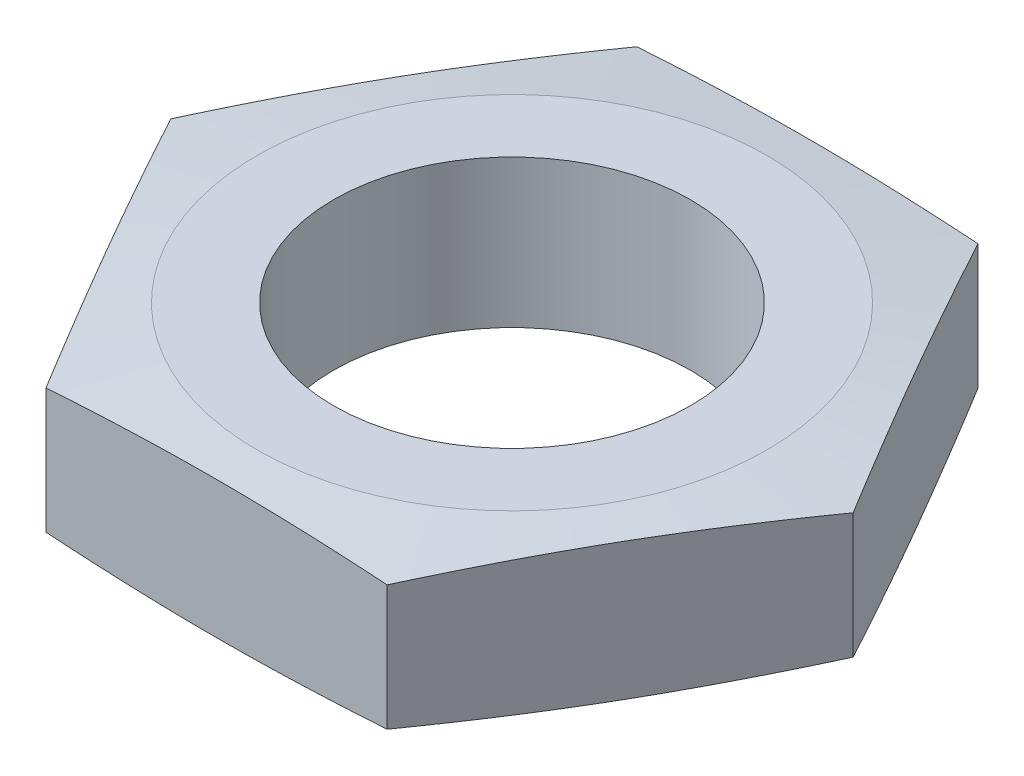
ISO-10303-21;
HEADER;
FILE_DESCRIPTION(('STEP AP214'),'2;1');
FILE_NAME('part.step','',(''),(''),'','','');
FILE_SCHEMA(('AUTOMOTIVE_DESIGN { 1 0 10303 214 1 1 1 1 }'));
ENDSEC;
DATA;
#1=APPLICATION_CONTEXT('core data for automotive mechanical design processes');
#2=APPLICATION_PROTOCOL_DEFINITION('international standard','automotive_design',2000,#1);
#3=PRODUCT_CONTEXT('',#1,'mechanical');
#4=PRODUCT('Part','Part','',(#3));
#5=PRODUCT_RELATED_PRODUCT_CATEGORY('part','',(#4));
#6=PRODUCT_DEFINITION_FORMATION('','',#4);
#7=PRODUCT_DEFINITION_CONTEXT('part definition',#1,'design');
#8=PRODUCT_DEFINITION('design','',#6,#7);
#9=PRODUCT_DEFINITION_SHAPE('','',#8);
#10=(LENGTH_UNIT() NAMED_UNIT(*) SI_UNIT(.MILLI.,.METRE.));
#11=(NAMED_UNIT(*) PLANE_ANGLE_UNIT() SI_UNIT($,.RADIAN.));
#12=(NAMED_UNIT(*) SI_UNIT($,.STERADIAN.) SOLID_ANGLE_UNIT());
#13=UNCERTAINTY_MEASURE_WITH_UNIT(LENGTH_MEASURE(1.E-05),#10,'distance_accuracy_value','');
#14=(GEOMETRIC_REPRESENTATION_CONTEXT(3) GLOBAL_UNCERTAINTY_ASSIGNED_CONTEXT((#13)) GLOBAL_UNIT_ASSIGNED_CONTEXT((#10,
#11,#12)) REPRESENTATION_CONTEXT('',''));
#15=CARTESIAN_POINT('',(0.,0.,0.));
#16=DIRECTION('',(0.,0.,1.));
#17=DIRECTION('',(1.,0.,0.));
#18=AXIS2_PLACEMENT_3D('',#15,#16,#17);
#19=CARTESIAN_POINT('',(13.856406460551,6.,0.));
#20=DIRECTION('',(-0.866025403784439,0.,0.5));
#21=DIRECTION('',(0.5,0.,0.866025403784439));
#22=AXIS2_PLACEMENT_3D('',#19,#20,#21);
#23=PLANE('',#22);
#24=CARTESIAN_POINT('',(13.8565219306049,5.53920105633311,0.000199999999998318));
#25=CARTESIAN_POINT('',(13.568071895555,5.5771929441104,-0.499410116151427));
#26=CARTESIAN_POINT('',(13.2794939637158,5.61161953747138,-0.999241756040067));
#27=CARTESIAN_POINT('',(12.7020915962059,5.67202825893365,-1.99933199297773));
#28=CARTESIAN_POINT('',(12.4132671398972,5.69800959222564,-2.49959062577279));
#29=CARTESIAN_POINT('',(11.8357975323813,5.74017982050631,-3.49979732581717));
#30=CARTESIAN_POINT('',(11.5471526103685,5.75638095189157,-3.99974499609018));
#31=CARTESIAN_POINT('',(10.9697734043392,5.77809920644825,-4.99979511616666));
#32=CARTESIAN_POINT('',(10.6810391248762,5.78361680551303,-5.49989755808333));
#33=CARTESIAN_POINT('',(10.1035705659503,5.78361680551303,-6.50010244191667));
#34=CARTESIAN_POINT('',(9.81483628648731,5.77809920644825,-7.00020488383334));
#35=CARTESIAN_POINT('',(9.23745708045804,5.75638095189157,-8.00025500390982));
#36=CARTESIAN_POINT('',(8.94881215844519,5.74017982050631,-8.50020267418283));
#37=CARTESIAN_POINT('',(8.3713425509293,5.69800959222564,-9.50040937422721));
#38=CARTESIAN_POINT('',(8.08251809462064,5.67202825893365,-10.0006680070223));
#39=CARTESIAN_POINT('',(7.50511572711076,5.61161953747139,-11.0007582439599));
#40=CARTESIAN_POINT('',(7.21653779527156,5.5771929441104,-11.5005898838486));
#41=CARTESIAN_POINT('',(6.92808776022167,5.53920105633312,-12.0002));
#42=B_SPLINE_CURVE_WITH_KNOTS('',3,(#24,#25,#26,#27,#28,#29,#30,#31,#32,#33,#34,#35,#36,#37,#38,
#39,#40,#41),.UNSPECIFIED.,.F.,.F.,(4,2,2,2,2,2,2,2,4),(0.,1.73446964464179,3.46910247830202,
5.20156052196439,6.93394139225431,8.66632226254422,10.3987803062066,12.1334131398668,
13.8678827845086),.UNSPECIFIED.);
#43=CARTESIAN_POINT('',(13.856406460551,5.53921625844412,0.));
#44=VERTEX_POINT('',#43);
#45=CARTESIAN_POINT('',(6.92820323027551,5.53921625844412,-12.));
#46=VERTEX_POINT('',#45);
#47=EDGE_CURVE('E89',#44,#46,#42,.T.);
#48=ORIENTED_EDGE('',*,*,#47,.F.);
#49=DIRECTION('',(0.,-1.,0.));
#50=VECTOR('',#49,1.);
#51=CARTESIAN_POINT('',(13.856406460551,6.,0.));
#52=LINE('',#51,#50);
#53=CARTESIAN_POINT('',(13.856406460551,0.460783741555837,0.));
#54=VERTEX_POINT('',#53);
#55=EDGE_CURVE('E59',#44,#54,#52,.T.);
#56=ORIENTED_EDGE('',*,*,#55,.T.);
#57=CARTESIAN_POINT('',(6.92808776022167,0.46079894366685,-12.0002));
#58=CARTESIAN_POINT('',(7.21653779527156,0.422807055889563,-11.5005898838486));
#59=CARTESIAN_POINT('',(7.50511572711076,0.388380462528575,-11.0007582439599));
#60=CARTESIAN_POINT('',(8.08251809462064,0.327971741066314,-10.0006680070223));
#61=CARTESIAN_POINT('',(8.3713425509293,0.301990407774326,-9.50040937422721));
#62=CARTESIAN_POINT('',(8.94881215844519,0.25982017949365,-8.50020267418283));
#63=CARTESIAN_POINT('',(9.23745708045804,0.243619048108396,-8.00025500390982));
#64=CARTESIAN_POINT('',(9.81483628648731,0.22190079355171,-7.00020488383334));
#65=CARTESIAN_POINT('',(10.1035705659503,0.216383194486936,-6.50010244191667));
#66=CARTESIAN_POINT('',(10.6810391248762,0.216383194486935,-5.49989755808333));
#67=CARTESIAN_POINT('',(10.9697734043392,0.221900793551709,-4.99979511616667));
#68=CARTESIAN_POINT('',(11.5471526103685,0.243619048108394,-3.99974499609018));
#69=CARTESIAN_POINT('',(11.8357975323813,0.259820179493647,-3.49979732581717));
#70=CARTESIAN_POINT('',(12.4132671398972,0.301990407774322,-2.49959062577279));
#71=CARTESIAN_POINT('',(12.7020915962059,0.32797174106631,-1.99933199297773));
#72=CARTESIAN_POINT('',(13.2794939637158,0.38838046252857,-0.999241756040064));
#73=CARTESIAN_POINT('',(13.568071895555,0.422807055889557,-0.499410116151426));
#74=CARTESIAN_POINT('',(13.8565219306049,0.460798943666844,0.000200000000000654));
#75=B_SPLINE_CURVE_WITH_KNOTS('',3,(#57,#58,#59,#60,#61,#62,#63,#64,#65,#66,#67,#68,#69,#70,#71,
#72,#73,#74),.UNSPECIFIED.,.F.,.F.,(4,2,2,2,2,2,2,2,4),(0.,1.73446964464178,3.46910247830202,
5.2015605219644,6.93394139225431,8.66632226254423,10.3987803062066,12.1334131398668,
13.8678827845086),.UNSPECIFIED.);
#76=CARTESIAN_POINT('',(6.9282032302755,0.460783741555843,-12.));
#77=VERTEX_POINT('',#76);
#78=EDGE_CURVE('E104',#77,#54,#75,.T.);
#79=ORIENTED_EDGE('',*,*,#78,.F.);
#80=DIRECTION('',(0.,-1.,0.));
#81=VECTOR('',#80,1.);
#82=CARTESIAN_POINT('',(6.92820323027551,6.,-12.));
#83=LINE('',#82,#81);
#84=EDGE_CURVE('E11',#46,#77,#83,.T.);
#85=ORIENTED_EDGE('',*,*,#84,.F.);
#86=EDGE_LOOP('',(#48,#56,#79,#85));
#87=FACE_BOUND('',#86,.T.);
#88=ADVANCED_FACE('F36',(#87),#23,.F.);
#89=CARTESIAN_POINT('',(6.92820323027551,6.,-12.));
#90=DIRECTION('',(0.,0.,1.));
#91=DIRECTION('',(1.,0.,0.));
#92=AXIS2_PLACEMENT_3D('',#89,#90,#91);
#93=PLANE('',#92);
#94=CARTESIAN_POINT('',(-18.2771435435556,4.48493792086526,-12.));
#95=CARTESIAN_POINT('',(-17.7325022290371,4.54486147563487,-12.));
#96=CARTESIAN_POINT('',(-17.1877749278224,4.60401723246416,-12.));
#97=CARTESIAN_POINT('',(-16.0981074868908,4.7203897679879,-12.));
#98=CARTESIAN_POINT('',(-15.5531673449194,4.77760652554683,-12.));
#99=CARTESIAN_POINT('',(-14.4629154682547,4.88970969877349,-12.));
#100=CARTESIAN_POINT('',(-13.9176036759832,4.94459555643758,-12.));
#101=CARTESIAN_POINT('',(-12.8266980870495,5.05148740141514,-12.));
#102=CARTESIAN_POINT('',(-12.2811042909962,5.10349339492182,-12.));
#103=CARTESIAN_POINT('',(-11.1905992029574,5.20387294502393,-12.));
#104=CARTESIAN_POINT('',(-10.6456885162395,5.25225304519558,-12.));
#105=CARTESIAN_POINT('',(-9.55550024084136,5.34467830956093,-12.));
#106=CARTESIAN_POINT('',(-9.01022265415777,5.38872349715577,-12.));
#107=CARTESIAN_POINT('',(-7.91927972672171,5.47151120988976,-12.));
#108=CARTESIAN_POINT('',(-7.37361439930037,5.51025390923629,-12.));
#109=CARTESIAN_POINT('',(-6.28186232976823,5.58133287411642,-12.));
#110=CARTESIAN_POINT('',(-5.73577558780116,5.61366914183417,-12.));
#111=CARTESIAN_POINT('',(-4.6417904877832,5.67083539164291,-12.));
#112=CARTESIAN_POINT('',(-4.09389109194578,5.69564578304351,-12.));
#113=CARTESIAN_POINT('',(-2.99776378518072,5.73653632009702,-12.));
#114=CARTESIAN_POINT('',(-2.44953587577036,5.75261650576497,-12.));
#115=CARTESIAN_POINT('',(-1.35293331086945,5.77520595095389,-12.));
#116=CARTESIAN_POINT('',(-0.804558675176236,5.78171615394902,-12.));
#117=CARTESIAN_POINT('',(0.292218868370737,5.78479758621478,-12.));
#118=CARTESIAN_POINT('',(0.840621776214361,5.78136881902403,-12.));
#119=CARTESIAN_POINT('',(1.93775589306152,5.76476284221265,-12.));
#120=CARTESIAN_POINT('',(2.48648697089035,5.75157712748093,-12.));
#121=CARTESIAN_POINT('',(3.58365446599168,5.71616154703021,-12.));
#122=CARTESIAN_POINT('',(4.13209088201244,5.6939316431903,-12.));
#123=CARTESIAN_POINT('',(5.22865127633366,5.64147629892808,-12.));
#124=CARTESIAN_POINT('',(5.77677520123959,5.611249758411,-12.));
#125=CARTESIAN_POINT('',(6.87260061439445,5.54398479030612,-12.));
#126=CARTESIAN_POINT('',(7.42030210222779,5.50694635602535,-12.));
#127=CARTESIAN_POINT('',(8.48783189709877,5.42920514261799,-12.));
#128=CARTESIAN_POINT('',(9.00768056776549,5.38877928146919,-12.));
#129=CARTESIAN_POINT('',(10.0470332733152,5.30369631349215,-12.));
#130=CARTESIAN_POINT('',(10.5665373056549,5.25903917578146,-12.));
#131=CARTESIAN_POINT('',(11.6052458893714,5.16624531684368,-12.));
#132=CARTESIAN_POINT('',(12.1244504330513,5.11810850988297,-12.));
#133=CARTESIAN_POINT('',(13.162586978277,5.01897365011092,-12.));
#134=CARTESIAN_POINT('',(13.6815189788542,4.96797558720039,-12.));
#135=CARTESIAN_POINT('',(15.23805447269,4.81146821006901,-12.));
#136=CARTESIAN_POINT('',(16.2753052031246,4.70245414511181,-12.));
#137=CARTESIAN_POINT('',(18.3490936670876,4.47805703077449,-12.));
#138=CARTESIAN_POINT('',(19.3856314114897,4.36267408081,-12.));
#139=CARTESIAN_POINT('',(21.4557376658167,4.12770097118489,-12.));
#140=CARTESIAN_POINT('',(22.4893073858952,4.00812144243749,-12.));
#141=CARTESIAN_POINT('',(24.5560728834144,3.76574040860357,-12.));
#142=CARTESIAN_POINT('',(25.5892686589956,3.64293888771143,-12.));
#143=CARTESIAN_POINT('',(27.654995141797,3.39500739063223,-12.));
#144=CARTESIAN_POINT('',(28.6875259538995,3.26987828650609,-12.));
#145=CARTESIAN_POINT('',(30.7523551718,3.01779291280188,-12.));
#146=CARTESIAN_POINT('',(31.7846535796201,2.89083665979841,-12.));
#147=CARTESIAN_POINT('',(32.816871597033,2.76323824041032,-12.));
#148=B_SPLINE_CURVE_WITH_KNOTS('',3,(#94,#95,#96,#97,#98,#99,#100,#101,#102,#103,#104,#105,#106,
#107,#108,#109,#110,#111,#112,#113,#114,#115,#116,#117,#118,#119,#120,#121,#122,#123,#124,#125,
#126,#127,#128,#129,#130,#131,#132,#133,#134,#135,#136,#137,#138,#139,#140,#141,#142,#143,#144,
#145,#146,#147),.UNSPECIFIED.,.F.,.F.,(4,2,2,2,2,2,2,2,2,2,2,2,2,2,2,2,2,2,2,2,2,2,2,2,2,2,4),
(0.,1.64378543211549,3.28758877610353,4.93178344379874,6.57597457548604,8.2171232086956,
9.85826298200766,11.4993488245394,13.140434107576,14.7857553647614,16.4310690805271,
18.0762205791645,19.7213714920692,21.3679581715289,23.014551791358,24.6613720504469,
26.3081939276151,27.8724280027137,29.4366734954325,31.0009575418627,32.5652471099916,
35.6941041543441,38.8229123723476,41.944297594367,45.0656981313247,48.1859518523562,
51.306177286493),.UNSPECIFIED.);
#149=CARTESIAN_POINT('',(-6.92820323027551,5.53921625844413,-12.));
#150=VERTEX_POINT('',#149);
#151=EDGE_CURVE('E97',#46,#150,#148,.F.);
#152=ORIENTED_EDGE('',*,*,#151,.F.);
#153=ORIENTED_EDGE('',*,*,#84,.T.);
#154=CARTESIAN_POINT('',(-18.2771435435556,1.51506207913473,-12.));
#155=CARTESIAN_POINT('',(-17.7325022290371,1.45513852436512,-12.));
#156=CARTESIAN_POINT('',(-17.1877749278224,1.39598276753583,-12.));
#157=CARTESIAN_POINT('',(-16.0981074868908,1.27961023201209,-12.));
#158=CARTESIAN_POINT('',(-15.5531673449194,1.22239347445316,-12.));
#159=CARTESIAN_POINT('',(-14.4629154682547,1.1102903012265,-12.));
#160=CARTESIAN_POINT('',(-13.9176036759832,1.05540444356241,-12.));
#161=CARTESIAN_POINT('',(-12.8266980870494,0.948512598584847,-12.));
#162=CARTESIAN_POINT('',(-12.2811042909962,0.896506605078167,-12.));
#163=CARTESIAN_POINT('',(-11.1905992029574,0.79612705497606,-12.));
#164=CARTESIAN_POINT('',(-10.6456885162395,0.747746954804407,-12.));
#165=CARTESIAN_POINT('',(-9.55550024084135,0.655321690439062,-12.));
#166=CARTESIAN_POINT('',(-9.01022265415777,0.611276502844215,-12.));
#167=CARTESIAN_POINT('',(-7.91927972672171,0.528488790110226,-12.));
#168=CARTESIAN_POINT('',(-7.37361439930037,0.489746090763701,-12.));
#169=CARTESIAN_POINT('',(-6.28186232976822,0.418667125883564,-12.));
#170=CARTESIAN_POINT('',(-5.73577558780116,0.386330858165813,-12.));
#171=CARTESIAN_POINT('',(-4.6417904877832,0.329164608357075,-12.));
#172=CARTESIAN_POINT('',(-4.09389109194578,0.304354216956472,-12.));
#173=CARTESIAN_POINT('',(-2.99776378518072,0.26346367990296,-12.));
#174=CARTESIAN_POINT('',(-2.44953587577036,0.247383494235014,-12.));
#175=CARTESIAN_POINT('',(-1.35293331086945,0.224794049046092,-12.));
#176=CARTESIAN_POINT('',(-0.804558675176242,0.218283846050957,-12.));
#177=CARTESIAN_POINT('',(0.292218868370728,0.215202413785198,-12.));
#178=CARTESIAN_POINT('',(0.840621776214352,0.218631180975946,-12.));
#179=CARTESIAN_POINT('',(1.93775589306151,0.23523715778733,-12.));
#180=CARTESIAN_POINT('',(2.48648697089033,0.248422872519042,-12.));
#181=CARTESIAN_POINT('',(3.58365446599167,0.283838452969763,-12.));
#182=CARTESIAN_POINT('',(4.13209088201243,0.306068356809669,-12.));
#183=CARTESIAN_POINT('',(5.22865127633365,0.358523701071885,-12.));
#184=CARTESIAN_POINT('',(5.77677520123958,0.388750241588968,-12.));
#185=CARTESIAN_POINT('',(6.87260061439445,0.456015209693845,-12.));
#186=CARTESIAN_POINT('',(7.42030210222778,0.493053643974613,-12.));
#187=CARTESIAN_POINT('',(8.48783189709877,0.57079485738197,-12.));
#188=CARTESIAN_POINT('',(9.00768056776548,0.611220718530767,-12.));
#189=CARTESIAN_POINT('',(10.0470332733152,0.696303686507803,-12.));
#190=CARTESIAN_POINT('',(10.5665373056549,0.740960824218496,-12.));
#191=CARTESIAN_POINT('',(11.6052458893714,0.833754683156276,-12.));
#192=CARTESIAN_POINT('',(12.1244504330513,0.881891490116981,-12.));
#193=CARTESIAN_POINT('',(13.162586978277,0.981026349889027,-12.));
#194=CARTESIAN_POINT('',(13.6815189788542,1.03202441279956,-12.));
#195=CARTESIAN_POINT('',(15.23805447269,1.18853178993093,-12.));
#196=CARTESIAN_POINT('',(16.2753052031246,1.29754585488813,-12.));
#197=CARTESIAN_POINT('',(18.3490936670876,1.52194296922544,-12.));
#198=CARTESIAN_POINT('',(19.3856314114898,1.63732591918992,-12.));
#199=CARTESIAN_POINT('',(21.4557376658167,1.87229902881503,-12.));
#200=CARTESIAN_POINT('',(22.4893073858952,1.99187855756242,-12.));
#201=CARTESIAN_POINT('',(24.5560728834144,2.23425959139634,-12.));
#202=CARTESIAN_POINT('',(25.5892686589956,2.35706111228847,-12.));
#203=CARTESIAN_POINT('',(27.654995141797,2.60499260936766,-12.));
#204=CARTESIAN_POINT('',(28.6875259538995,2.73012171349381,-12.));
#205=CARTESIAN_POINT('',(30.7523551718,2.982207087198,-12.));
#206=CARTESIAN_POINT('',(31.7846535796201,3.10916334020147,-12.));
#207=CARTESIAN_POINT('',(32.816871597033,3.23676175958955,-12.));
#208=B_SPLINE_CURVE_WITH_KNOTS('',3,(#154,#155,#156,#157,#158,#159,#160,#161,#162,#163,#164,
#165,#166,#167,#168,#169,#170,#171,#172,#173,#174,#175,#176,#177,#178,#179,#180,#181,#182,#183,
#184,#185,#186,#187,#188,#189,#190,#191,#192,#193,#194,#195,#196,#197,#198,#199,#200,#201,#202,
#203,#204,#205,#206,#207),.UNSPECIFIED.,.F.,.F.,(4,2,2,2,2,2,2,2,2,2,2,2,2,2,2,2,2,2,2,2,2,2,2,
2,2,2,4),(0.,1.64378543211549,3.28758877610353,4.93178344379874,6.57597457548605,
8.2171232086956,9.85826298200766,11.4993488245394,13.140434107576,14.7857553647614,
16.4310690805271,18.0762205791645,19.7213714920691,21.3679581715289,23.014551791358,
24.6613720504469,26.3081939276151,27.8724280027137,29.4366734954325,31.0009575418627,
32.5652471099916,35.6941041543441,38.8229123723476,41.944297594367,45.0656981313247,
48.1859518523562,51.306177286493),.UNSPECIFIED.);
#209=CARTESIAN_POINT('',(-6.92820323027551,0.460783741555855,-12.));
#210=VERTEX_POINT('',#209);
#211=EDGE_CURVE('E108',#210,#77,#208,.T.);
#212=ORIENTED_EDGE('',*,*,#211,.F.);
#213=DIRECTION('',(0.,-1.,0.));
#214=VECTOR('',#213,1.);
#215=CARTESIAN_POINT('',(-6.92820323027551,6.,-12.));
#216=LINE('',#215,#214);
#217=EDGE_CURVE('E44',#150,#210,#216,.T.);
#218=ORIENTED_EDGE('',*,*,#217,.F.);
#219=EDGE_LOOP('',(#152,#153,#212,#218));
#220=FACE_BOUND('',#219,.T.);
#221=ADVANCED_FACE('F137',(#220),#93,.F.);
#222=CARTESIAN_POINT('',(-6.92820323027551,6.,-12.));
#223=DIRECTION('',(0.866025403784439,0.,0.5));
#224=DIRECTION('',(0.5,0.,-0.866025403784439));
#225=AXIS2_PLACEMENT_3D('',#222,#223,#224);
#226=PLANE('',#225);
#227=CARTESIAN_POINT('',(-6.92808776022167,5.53920105633313,-12.0002));
#228=CARTESIAN_POINT('',(-7.21653779527156,5.57719294411041,-11.5005898838486));
#229=CARTESIAN_POINT('',(-7.50511572711076,5.6116195374714,-11.0007582439599));
#230=CARTESIAN_POINT('',(-8.08251809462063,5.67202825893366,-10.0006680070223));
#231=CARTESIAN_POINT('',(-8.3713425509293,5.69800959222565,-9.50040937422721));
#232=CARTESIAN_POINT('',(-8.94881215844518,5.74017982050633,-8.50020267418283));
#233=CARTESIAN_POINT('',(-9.23745708045804,5.75638095189158,-8.00025500390982));
#234=CARTESIAN_POINT('',(-9.81483628648731,5.77809920644827,-7.00020488383334));
#235=CARTESIAN_POINT('',(-10.1035705659503,5.78361680551304,-6.50010244191667));
#236=CARTESIAN_POINT('',(-10.6810391248762,5.78361680551304,-5.49989755808333));
#237=CARTESIAN_POINT('',(-10.9697734043392,5.77809920644827,-4.99979511616666));
#238=CARTESIAN_POINT('',(-11.5471526103685,5.75638095189159,-3.99974499609018));
#239=CARTESIAN_POINT('',(-11.8357975323813,5.74017982050633,-3.49979732581717));
#240=CARTESIAN_POINT('',(-12.4132671398972,5.69800959222566,-2.49959062577279));
#241=CARTESIAN_POINT('',(-12.7020915962059,5.67202825893367,-1.99933199297773));
#242=CARTESIAN_POINT('',(-13.2794939637158,5.61161953747141,-0.999241756040065));
#243=CARTESIAN_POINT('',(-13.568071895555,5.57719294411042,-0.499410116151425));
#244=CARTESIAN_POINT('',(-13.8565219306049,5.53920105633313,0.000200000000001777));
#245=B_SPLINE_CURVE_WITH_KNOTS('',3,(#227,#228,#229,#230,#231,#232,#233,#234,#235,#236,#237,
#238,#239,#240,#241,#242,#243,#244),.UNSPECIFIED.,.F.,.F.,(4,2,2,2,2,2,2,2,4),(0.,
1.73446964464179,3.46910247830202,5.20156052196439,6.93394139225431,8.66632226254423,
10.3987803062066,12.1334131398668,13.8678827845086),.UNSPECIFIED.);
#246=CARTESIAN_POINT('',(-13.856406460551,5.53921625844414,0.));
#247=VERTEX_POINT('',#246);
#248=EDGE_CURVE('E126',#150,#247,#245,.T.);
#249=ORIENTED_EDGE('',*,*,#248,.F.);
#250=ORIENTED_EDGE('',*,*,#217,.T.);
#251=CARTESIAN_POINT('',(-13.8565219306049,0.460798943666867,0.000200000000005204));
#252=CARTESIAN_POINT('',(-13.568071895555,0.422807055889581,-0.49941011615142));
#253=CARTESIAN_POINT('',(-13.2794939637158,0.388380462528592,-0.99924175604006));
#254=CARTESIAN_POINT('',(-12.7020915962059,0.327971741066332,-1.99933199297772));
#255=CARTESIAN_POINT('',(-12.4132671398972,0.301990407774343,-2.49959062577279));
#256=CARTESIAN_POINT('',(-11.8357975323813,0.259820179493667,-3.49979732581717));
#257=CARTESIAN_POINT('',(-11.5471526103685,0.243619048108413,-3.99974499609018));
#258=CARTESIAN_POINT('',(-10.9697734043392,0.221900793551728,-4.99979511616666));
#259=CARTESIAN_POINT('',(-10.6810391248762,0.216383194486954,-5.49989755808333));
#260=CARTESIAN_POINT('',(-10.1035705659503,0.216383194486953,-6.50010244191667));
#261=CARTESIAN_POINT('',(-9.81483628648731,0.221900793551727,-7.00020488383334));
#262=CARTESIAN_POINT('',(-9.23745708045804,0.243619048108411,-8.00025500390982));
#263=CARTESIAN_POINT('',(-8.94881215844519,0.259820179493665,-8.50020267418283));
#264=CARTESIAN_POINT('',(-8.3713425509293,0.30199040777434,-9.50040937422721));
#265=CARTESIAN_POINT('',(-8.08251809462064,0.327971741066328,-10.0006680070223));
#266=CARTESIAN_POINT('',(-7.50511572711076,0.388380462528587,-11.0007582439599));
#267=CARTESIAN_POINT('',(-7.21653779527156,0.422807055889575,-11.5005898838486));
#268=CARTESIAN_POINT('',(-6.92808776022167,0.460798943666862,-12.0002));
#269=B_SPLINE_CURVE_WITH_KNOTS('',3,(#251,#252,#253,#254,#255,#256,#257,#258,#259,#260,#261,
#262,#263,#264,#265,#266,#267,#268),.UNSPECIFIED.,.F.,.F.,(4,2,2,2,2,2,2,2,4),(0.,
1.73446964464178,3.46910247830202,5.2015605219644,6.93394139225431,8.66632226254423,
10.3987803062066,12.1334131398668,13.8678827845086),.UNSPECIFIED.);
#270=CARTESIAN_POINT('',(-13.856406460551,0.460783741555861,0.));
#271=VERTEX_POINT('',#270);
#272=EDGE_CURVE('E125',#271,#210,#269,.T.);
#273=ORIENTED_EDGE('',*,*,#272,.F.);
#274=DIRECTION('',(0.,-1.,0.));
#275=VECTOR('',#274,1.);
#276=CARTESIAN_POINT('',(-13.856406460551,6.,0.));
#277=LINE('',#276,#275);
#278=EDGE_CURVE('E117',#247,#271,#277,.T.);
#279=ORIENTED_EDGE('',*,*,#278,.F.);
#280=EDGE_LOOP('',(#249,#250,#273,#279));
#281=FACE_BOUND('',#280,.T.);
#282=ADVANCED_FACE('F123',(#281),#226,.F.);
#283=CARTESIAN_POINT('',(-13.856406460551,6.,0.));
#284=DIRECTION('',(0.866025403784438,0.,-0.5));
#285=DIRECTION('',(-0.5,0.,-0.866025403784438));
#286=AXIS2_PLACEMENT_3D('',#283,#284,#285);
#287=PLANE('',#286);
#288=CARTESIAN_POINT('',(-13.8565219306049,5.53920105633313,-0.000199999999994832));
#289=CARTESIAN_POINT('',(-13.568071895555,5.57719294411042,0.499410116151432));
#290=CARTESIAN_POINT('',(-13.2794939637158,5.61161953747141,0.999241756040071));
#291=CARTESIAN_POINT('',(-12.7020915962059,5.67202825893367,1.99933199297774));
#292=CARTESIAN_POINT('',(-12.4132671398972,5.69800959222566,2.4995906257728));
#293=CARTESIAN_POINT('',(-11.8357975323813,5.74017982050633,3.49979732581717));
#294=CARTESIAN_POINT('',(-11.5471526103685,5.75638095189159,3.99974499609019));
#295=CARTESIAN_POINT('',(-10.9697734043392,5.77809920644827,4.99979511616667));
#296=CARTESIAN_POINT('',(-10.6810391248762,5.78361680551304,5.49989755808334));
#297=CARTESIAN_POINT('',(-10.1035705659503,5.78361680551304,6.50010244191667));
#298=CARTESIAN_POINT('',(-9.81483628648731,5.77809920644827,7.00020488383334));
#299=CARTESIAN_POINT('',(-9.23745708045803,5.75638095189158,8.00025500390982));
#300=CARTESIAN_POINT('',(-8.94881215844518,5.74017982050633,8.50020267418284));
#301=CARTESIAN_POINT('',(-8.37134255092929,5.69800959222565,9.50040937422721));
#302=CARTESIAN_POINT('',(-8.08251809462063,5.67202825893366,10.0006680070223));
#303=CARTESIAN_POINT('',(-7.50511572711075,5.6116195374714,11.0007582439599));
#304=CARTESIAN_POINT('',(-7.21653779527155,5.57719294411041,11.5005898838486));
#305=CARTESIAN_POINT('',(-6.92808776022167,5.53920105633313,12.0002));
#306=B_SPLINE_CURVE_WITH_KNOTS('',3,(#288,#289,#290,#291,#292,#293,#294,#295,#296,#297,#298,
#299,#300,#301,#302,#303,#304,#305),.UNSPECIFIED.,.F.,.F.,(4,2,2,2,2,2,2,2,4),(0.,
1.73446964464179,3.46910247830202,5.20156052196439,6.93394139225431,8.66632226254423,
10.3987803062066,12.1334131398668,13.8678827845086),.UNSPECIFIED.);
#307=CARTESIAN_POINT('',(-6.9282032302755,5.53921625844413,12.));
#308=VERTEX_POINT('',#307);
#309=EDGE_CURVE('E187',#247,#308,#306,.T.);
#310=ORIENTED_EDGE('',*,*,#309,.F.);
#311=ORIENTED_EDGE('',*,*,#278,.T.);
#312=CARTESIAN_POINT('',(-6.92808776022166,0.460798943666862,12.0002));
#313=CARTESIAN_POINT('',(-7.21653779527155,0.422807055889575,11.5005898838486));
#314=CARTESIAN_POINT('',(-7.50511572711075,0.388380462528587,11.0007582439599));
#315=CARTESIAN_POINT('',(-8.08251809462063,0.327971741066328,10.0006680070223));
#316=CARTESIAN_POINT('',(-8.37134255092929,0.30199040777434,9.50040937422722));
#317=CARTESIAN_POINT('',(-8.94881215844518,0.259820179493665,8.50020267418284));
#318=CARTESIAN_POINT('',(-9.23745708045803,0.243619048108411,8.00025500390982));
#319=CARTESIAN_POINT('',(-9.8148362864873,0.221900793551727,7.00020488383334));
#320=CARTESIAN_POINT('',(-10.1035705659503,0.216383194486953,6.50010244191668));
#321=CARTESIAN_POINT('',(-10.6810391248762,0.216383194486954,5.49989755808334));
#322=CARTESIAN_POINT('',(-10.9697734043392,0.221900793551728,4.99979511616667));
#323=CARTESIAN_POINT('',(-11.5471526103685,0.243619048108413,3.99974499609019));
#324=CARTESIAN_POINT('',(-11.8357975323813,0.259820179493667,3.49979732581718));
#325=CARTESIAN_POINT('',(-12.4132671398972,0.301990407774343,2.4995906257728));
#326=CARTESIAN_POINT('',(-12.7020915962059,0.327971741066332,1.99933199297774));
#327=CARTESIAN_POINT('',(-13.2794939637158,0.388380462528592,0.999241756040072));
#328=CARTESIAN_POINT('',(-13.568071895555,0.422807055889581,0.499410116151434));
#329=CARTESIAN_POINT('',(-13.8565219306049,0.460798943666867,-0.000199999999992286));
#330=B_SPLINE_CURVE_WITH_KNOTS('',3,(#312,#313,#314,#315,#316,#317,#318,#319,#320,#321,#322,
#323,#324,#325,#326,#327,#328,#329),.UNSPECIFIED.,.F.,.F.,(4,2,2,2,2,2,2,2,4),(0.,
1.73446964464179,3.46910247830202,5.2015605219644,6.93394139225431,8.66632226254423,
10.3987803062066,12.1334131398668,13.8678827845086),.UNSPECIFIED.);
#331=CARTESIAN_POINT('',(-6.9282032302755,0.460783741555855,12.));
#332=VERTEX_POINT('',#331);
#333=EDGE_CURVE('E135',#332,#271,#330,.T.);
#334=ORIENTED_EDGE('',*,*,#333,.F.);
#335=DIRECTION('',(0.,-1.,0.));
#336=VECTOR('',#335,1.);
#337=CARTESIAN_POINT('',(-6.9282032302755,6.,12.));
#338=LINE('',#337,#336);
#339=EDGE_CURVE('E106',#308,#332,#338,.T.);
#340=ORIENTED_EDGE('',*,*,#339,.F.);
#341=EDGE_LOOP('',(#310,#311,#334,#340));
#342=FACE_BOUND('',#341,.T.);
#343=ADVANCED_FACE('F178',(#342),#287,.F.);
#344=CARTESIAN_POINT('',(-6.9282032302755,6.,12.));
#345=DIRECTION('',(0.,0.,-1.));
#346=DIRECTION('',(-1.,0.,0.));
#347=AXIS2_PLACEMENT_3D('',#344,#345,#346);
#348=PLANE('',#347);
#349=CARTESIAN_POINT('',(-18.277156626408,4.48493648106766,12.));
#350=CARTESIAN_POINT('',(-17.7325147709298,4.54486010825835,12.));
#351=CARTESIAN_POINT('',(-17.1877869287012,4.60401593719421,12.));
#352=CARTESIAN_POINT('',(-16.0981184055543,4.72038861571347,12.));
#353=CARTESIAN_POINT('',(-15.5531777223815,4.77760544416132,12.));
#354=CARTESIAN_POINT('',(-14.4629247626207,4.88970875740646,12.));
#355=CARTESIAN_POINT('',(-13.9176124284542,4.94459468419832,12.));
#356=CARTESIAN_POINT('',(-12.826705755383,5.05148666468272,12.));
#357=CARTESIAN_POINT('',(-12.2811114170872,5.10349272456846,12.));
#358=CARTESIAN_POINT('',(-11.1906052474243,5.2038724030183,12.));
#359=CARTESIAN_POINT('',(-10.6456940213271,5.25225256518125,12.));
#360=CARTESIAN_POINT('',(-9.55550466656781,5.34467794764917,12.));
#361=CARTESIAN_POINT('',(-9.0102265399024,5.38872319135537,12.));
#362=CARTESIAN_POINT('',(-7.91928253184829,5.47151100794094,12.));
#363=CARTESIAN_POINT('',(-7.37361666379081,5.51025375502874,12.));
#364=CARTESIAN_POINT('',(-6.28186351214229,5.58133280391084,12.));
#365=CARTESIAN_POINT('',(-5.73577622869499,5.61366910788927,12.));
#366=CARTESIAN_POINT('',(-4.64179003174517,5.67083541592898,12.));
#367=CARTESIAN_POINT('',(-4.09389008044536,5.69564582909754,12.));
#368=CARTESIAN_POINT('',(-2.99776166218577,5.73653639098108,12.));
#369=CARTESIAN_POINT('',(-2.44953319674328,5.75261657971141,12.));
#370=CARTESIAN_POINT('',(-1.3529295198373,5.77520601030062,12.));
#371=CARTESIAN_POINT('',(-0.804554328171206,5.78171619563769,12.));
#372=CARTESIAN_POINT('',(0.292224326842007,5.78479757207738,12.));
#373=CARTESIAN_POINT('',(0.840627790178991,5.78136876671855,12.));
#374=CARTESIAN_POINT('',(1.93776301805292,5.76476269559734,12.));
#375=CARTESIAN_POINT('',(2.48649465141414,5.75157692469867,12.));
#376=CARTESIAN_POINT('',(3.58366325637744,5.71616121810819,12.));
#377=CARTESIAN_POINT('',(4.13210022672775,5.69393124429522,12.));
#378=CARTESIAN_POINT('',(5.22866172888153,5.64147575074884,12.));
#379=CARTESIAN_POINT('',(5.77678620729013,5.61124913091549,12.));
#380=CARTESIAN_POINT('',(6.87261272650454,5.54398399870849,12.));
#381=CARTESIAN_POINT('',(7.42031476689476,5.50694547964187,12.));
#382=CARTESIAN_POINT('',(8.48784511089759,5.42920413673512,12.));
#383=CARTESIAN_POINT('',(9.00769377855377,5.38877823618766,12.));
#384=CARTESIAN_POINT('',(10.0470464783491,5.30369519633369,12.));
#385=CARTESIAN_POINT('',(10.566550507945,5.25903802614488,12.));
#386=CARTESIAN_POINT('',(11.605259086439,5.16624410805895,12.));
#387=CARTESIAN_POINT('',(12.1244636276403,5.11810727442873,12.));
#388=CARTESIAN_POINT('',(13.1626001682265,5.0189723660851,12.));
#389=CARTESIAN_POINT('',(13.681532166643,4.96797428127254,12.));
#390=CARTESIAN_POINT('',(15.2380676533445,4.81146684428822,12.));
#391=CARTESIAN_POINT('',(16.2753183792497,4.70245274713791,12.));
#392=CARTESIAN_POINT('',(18.3491068351371,4.47805557828616,12.));
#393=CARTESIAN_POINT('',(19.3856445759931,4.36267260599983,12.));
#394=CARTESIAN_POINT('',(21.4557508196342,4.12769945872494,12.));
#395=CARTESIAN_POINT('',(22.4893205325737,4.00811991465268,12.));
#396=CARTESIAN_POINT('',(24.5560860162638,3.76573885448825,12.));
#397=CARTESIAN_POINT('',(25.5892817851548,3.64293732259055,12.));
#398=CARTESIAN_POINT('',(27.655008256955,3.39500580619375,12.));
#399=CARTESIAN_POINT('',(28.6875390647455,3.2698766937498,12.));
#400=CARTESIAN_POINT('',(30.7523682742949,3.01779130551308,12.));
#401=CARTESIAN_POINT('',(31.7846666780758,2.89083504629484,12.));
#402=CARTESIAN_POINT('',(32.8168846915281,2.76323662133658,12.));
#403=B_SPLINE_CURVE_WITH_KNOTS('',3,(#349,#350,#351,#352,#353,#354,#355,#356,#357,#358,#359,
#360,#361,#362,#363,#364,#365,#366,#367,#368,#369,#370,#371,#372,#373,#374,#375,#376,#377,#378,
#379,#380,#381,#382,#383,#384,#385,#386,#387,#388,#389,#390,#391,#392,#393,#394,#395,#396,#397,
#398,#399,#400,#401,#402),.UNSPECIFIED.,.F.,.F.,(4,2,2,2,2,2,2,2,2,2,2,2,2,2,2,2,2,2,2,2,2,2,2,
2,2,2,4),(0.,1.64378706902317,3.28759204994503,4.93178835591656,6.57598112587722,
8.21713138731077,9.85827278882203,11.4993602592593,13.1404471702028,14.7857700948293,
16.4310854779861,18.076238643508,19.7213912233129,21.367979572743,23.0145748625864,
24.6613967927206,26.3082203409325,27.8724544162635,29.4366999091707,31.0009839556154,
32.5652735237396,35.6941305647819,38.8229387796545,41.9443239857026,45.0657245066362,
48.1859782178322,51.3062036422232),.UNSPECIFIED.);
#404=CARTESIAN_POINT('',(6.92820323027551,5.53921625844412,12.));
#405=VERTEX_POINT('',#404);
#406=EDGE_CURVE('E51',#308,#405,#403,.T.);
#407=ORIENTED_EDGE('',*,*,#406,.F.);
#408=ORIENTED_EDGE('',*,*,#339,.T.);
#409=CARTESIAN_POINT('',(-18.277156626408,1.51506351893233,12.));
#410=CARTESIAN_POINT('',(-17.7325147709298,1.45513989174164,12.));
#411=CARTESIAN_POINT('',(-17.1877869287012,1.39598406280578,12.));
#412=CARTESIAN_POINT('',(-16.0981184055543,1.27961138428652,12.));
#413=CARTESIAN_POINT('',(-15.5531777223815,1.22239455583868,12.));
#414=CARTESIAN_POINT('',(-14.4629247626207,1.11029124259353,12.));
#415=CARTESIAN_POINT('',(-13.9176124284542,1.05540531580167,12.));
#416=CARTESIAN_POINT('',(-12.826705755383,0.948513335317268,12.));
#417=CARTESIAN_POINT('',(-12.2811114170872,0.89650727543153,12.));
#418=CARTESIAN_POINT('',(-11.1906052474243,0.796127596981687,12.));
#419=CARTESIAN_POINT('',(-10.6456940213271,0.74774743481874,12.));
#420=CARTESIAN_POINT('',(-9.55550466656781,0.655322052350821,12.));
#421=CARTESIAN_POINT('',(-9.0102265399024,0.611276808644619,12.));
#422=CARTESIAN_POINT('',(-7.9192825318483,0.528488992059049,12.));
#423=CARTESIAN_POINT('',(-7.37361666379081,0.489746244971247,12.));
#424=CARTESIAN_POINT('',(-6.28186351214229,0.418667196089148,12.));
#425=CARTESIAN_POINT('',(-5.73577622869499,0.386330892110716,12.));
#426=CARTESIAN_POINT('',(-4.64179003174517,0.329164584071009,12.));
#427=CARTESIAN_POINT('',(-4.09389008044536,0.30435417090245,12.));
#428=CARTESIAN_POINT('',(-2.99776166218577,0.263463609018904,12.));
#429=CARTESIAN_POINT('',(-2.44953319674328,0.24738342028857,12.));
#430=CARTESIAN_POINT('',(-1.3529295198373,0.224793989699361,12.));
#431=CARTESIAN_POINT('',(-0.804554328171207,0.218283804362292,12.));
#432=CARTESIAN_POINT('',(0.292224326842006,0.215202427922596,12.));
#433=CARTESIAN_POINT('',(0.84062779017899,0.218631233281432,12.));
#434=CARTESIAN_POINT('',(1.93776301805292,0.235237304402635,12.));
#435=CARTESIAN_POINT('',(2.48649465141414,0.248423075301301,12.));
#436=CARTESIAN_POINT('',(3.58366325637743,0.28383878189178,12.));
#437=CARTESIAN_POINT('',(4.13210022672774,0.306068755704752,12.));
#438=CARTESIAN_POINT('',(5.22866172888152,0.358524249251128,12.));
#439=CARTESIAN_POINT('',(5.77678620729012,0.388750869084475,12.));
#440=CARTESIAN_POINT('',(6.87261272650453,0.456016001291472,12.));
#441=CARTESIAN_POINT('',(7.42031476689475,0.493054520358089,12.));
#442=CARTESIAN_POINT('',(8.48784511089758,0.570795863264836,12.));
#443=CARTESIAN_POINT('',(9.00769377855376,0.611221763812294,12.));
#444=CARTESIAN_POINT('',(10.0470464783491,0.696304803666269,12.));
#445=CARTESIAN_POINT('',(10.566550507945,0.740961973855071,12.));
#446=CARTESIAN_POINT('',(11.605259086439,0.833755891941001,12.));
#447=CARTESIAN_POINT('',(12.1244636276402,0.881892725571217,12.));
#448=CARTESIAN_POINT('',(13.1626001682265,0.981027633914848,12.));
#449=CARTESIAN_POINT('',(13.681532166643,1.0320257187274,12.));
#450=CARTESIAN_POINT('',(15.2380676533445,1.18853315571172,12.));
#451=CARTESIAN_POINT('',(16.2753183792497,1.29754725286202,12.));
#452=CARTESIAN_POINT('',(18.3491068351371,1.52194442171377,12.));
#453=CARTESIAN_POINT('',(19.3856445759931,1.63732739400009,12.));
#454=CARTESIAN_POINT('',(21.4557508196342,1.87230054127497,12.));
#455=CARTESIAN_POINT('',(22.4893205325736,1.99188008534723,12.));
#456=CARTESIAN_POINT('',(24.5560860162638,2.23426114551165,12.));
#457=CARTESIAN_POINT('',(25.5892817851548,2.35706267740935,12.));
#458=CARTESIAN_POINT('',(27.655008256955,2.60499419380614,12.));
#459=CARTESIAN_POINT('',(28.6875390647455,2.73012330625009,12.));
#460=CARTESIAN_POINT('',(30.7523682742949,2.9822086944868,12.));
#461=CARTESIAN_POINT('',(31.7846666780758,3.10916495370504,12.));
#462=CARTESIAN_POINT('',(32.8168846915281,3.2367633786633,12.));
#463=B_SPLINE_CURVE_WITH_KNOTS('',3,(#409,#410,#411,#412,#413,#414,#415,#416,#417,#418,#419,
#420,#421,#422,#423,#424,#425,#426,#427,#428,#429,#430,#431,#432,#433,#434,#435,#436,#437,#438,
#439,#440,#441,#442,#443,#444,#445,#446,#447,#448,#449,#450,#451,#452,#453,#454,#455,#456,#457,
#458,#459,#460,#461,#462),.UNSPECIFIED.,.F.,.F.,(4,2,2,2,2,2,2,2,2,2,2,2,2,2,2,2,2,2,2,2,2,2,2,
2,2,2,4),(0.,1.64378706902317,3.28759204994502,4.93178835591656,6.57598112587721,
8.21713138731077,9.85827278882203,11.4993602592593,13.1404471702028,14.7857700948293,
16.4310854779861,18.076238643508,19.7213912233129,21.367979572743,23.0145748625864,
24.6613967927206,26.3082203409325,27.8724544162635,29.4366999091707,31.0009839556153,
32.5652735237396,35.6941305647819,38.8229387796544,41.9443239857025,45.0657245066361,
48.1859782178322,51.3062036422232),.UNSPECIFIED.);
#464=CARTESIAN_POINT('',(6.92820323027552,0.460783741555843,12.));
#465=VERTEX_POINT('',#464);
#466=EDGE_CURVE('E168',#465,#332,#463,.F.);
#467=ORIENTED_EDGE('',*,*,#466,.F.);
#468=DIRECTION('',(0.,-1.,0.));
#469=VECTOR('',#468,1.);
#470=CARTESIAN_POINT('',(6.92820323027551,6.,12.));
#471=LINE('',#470,#469);
#472=EDGE_CURVE('E103',#405,#465,#471,.T.);
#473=ORIENTED_EDGE('',*,*,#472,.F.);
#474=EDGE_LOOP('',(#407,#408,#467,#473));
#475=FACE_BOUND('',#474,.T.);
#476=ADVANCED_FACE('F181',(#475),#348,.F.);
#477=CARTESIAN_POINT('',(6.92820323027551,6.,12.));
#478=DIRECTION('',(-0.866025403784439,0.,-0.5));
#479=DIRECTION('',(-0.5,0.,0.866025403784439));
#480=AXIS2_PLACEMENT_3D('',#477,#478,#479);
#481=PLANE('',#480);
#482=CARTESIAN_POINT('',(6.92808776022167,5.53920105633311,12.0002));
#483=CARTESIAN_POINT('',(7.21653779527156,5.5771929441104,11.5005898838486));
#484=CARTESIAN_POINT('',(7.50511572711076,5.61161953747139,11.0007582439599));
#485=CARTESIAN_POINT('',(8.08251809462064,5.67202825893365,10.0006680070223));
#486=CARTESIAN_POINT('',(8.3713425509293,5.69800959222564,9.50040937422721));
#487=CARTESIAN_POINT('',(8.94881215844519,5.74017982050631,8.50020267418284));
#488=CARTESIAN_POINT('',(9.23745708045804,5.75638095189157,8.00025500390982));
#489=CARTESIAN_POINT('',(9.81483628648731,5.77809920644825,7.00020488383334));
#490=CARTESIAN_POINT('',(10.1035705659503,5.78361680551303,6.50010244191667));
#491=CARTESIAN_POINT('',(10.6810391248762,5.78361680551303,5.49989755808333));
#492=CARTESIAN_POINT('',(10.9697734043392,5.77809920644825,4.99979511616666));
#493=CARTESIAN_POINT('',(11.5471526103685,5.75638095189157,3.99974499609018));
#494=CARTESIAN_POINT('',(11.8357975323813,5.74017982050631,3.49979732581717));
#495=CARTESIAN_POINT('',(12.4132671398972,5.69800959222563,2.49959062577279));
#496=CARTESIAN_POINT('',(12.7020915962059,5.67202825893365,1.99933199297773));
#497=CARTESIAN_POINT('',(13.2794939637158,5.61161953747138,0.999241756040064));
#498=CARTESIAN_POINT('',(13.568071895555,5.5771929441104,0.499410116151424));
#499=CARTESIAN_POINT('',(13.8565219306049,5.53920105633311,-0.000200000000002874));
#500=B_SPLINE_CURVE_WITH_KNOTS('',3,(#482,#483,#484,#485,#486,#487,#488,#489,#490,#491,#492,
#493,#494,#495,#496,#497,#498,#499),.UNSPECIFIED.,.F.,.F.,(4,2,2,2,2,2,2,2,4),(0.,
1.73446964464179,3.46910247830202,5.2015605219644,6.93394139225431,8.66632226254423,
10.3987803062066,12.1334131398668,13.8678827845086),.UNSPECIFIED.);
#501=EDGE_CURVE('E87',#405,#44,#500,.T.);
#502=ORIENTED_EDGE('',*,*,#501,.F.);
#503=ORIENTED_EDGE('',*,*,#472,.T.);
#504=CARTESIAN_POINT('',(13.8565219306049,0.460798943666844,-0.000200000000001735));
#505=CARTESIAN_POINT('',(13.568071895555,0.422807055889557,0.499410116151424));
#506=CARTESIAN_POINT('',(13.2794939637158,0.388380462528569,0.999241756040064));
#507=CARTESIAN_POINT('',(12.7020915962059,0.32797174106631,1.99933199297773));
#508=CARTESIAN_POINT('',(12.4132671398972,0.301990407774322,2.49959062577279));
#509=CARTESIAN_POINT('',(11.8357975323813,0.259820179493647,3.49979732581717));
#510=CARTESIAN_POINT('',(11.5471526103685,0.243619048108393,3.99974499609018));
#511=CARTESIAN_POINT('',(10.9697734043392,0.221900793551709,4.99979511616666));
#512=CARTESIAN_POINT('',(10.6810391248762,0.216383194486936,5.49989755808333));
#513=CARTESIAN_POINT('',(10.1035705659503,0.216383194486936,6.50010244191667));
#514=CARTESIAN_POINT('',(9.81483628648731,0.22190079355171,7.00020488383334));
#515=CARTESIAN_POINT('',(9.23745708045804,0.243619048108395,8.00025500390982));
#516=CARTESIAN_POINT('',(8.94881215844519,0.25982017949365,8.50020267418283));
#517=CARTESIAN_POINT('',(8.3713425509293,0.301990407774326,9.50040937422721));
#518=CARTESIAN_POINT('',(8.08251809462064,0.327971741066314,10.0006680070223));
#519=CARTESIAN_POINT('',(7.50511572711076,0.388380462528575,11.0007582439599));
#520=CARTESIAN_POINT('',(7.21653779527156,0.422807055889563,11.5005898838486));
#521=CARTESIAN_POINT('',(6.92808776022168,0.46079894366685,12.0002));
#522=B_SPLINE_CURVE_WITH_KNOTS('',3,(#504,#505,#506,#507,#508,#509,#510,#511,#512,#513,#514,
#515,#516,#517,#518,#519,#520,#521),.UNSPECIFIED.,.F.,.F.,(4,2,2,2,2,2,2,2,4),(0.,
1.73446964464178,3.46910247830202,5.20156052196439,6.93394139225431,8.66632226254423,
10.3987803062066,12.1334131398668,13.8678827845086),.UNSPECIFIED.);
#523=EDGE_CURVE('E102',#54,#465,#522,.T.);
#524=ORIENTED_EDGE('',*,*,#523,.F.);
#525=ORIENTED_EDGE('',*,*,#55,.F.);
#526=EDGE_LOOP('',(#502,#503,#524,#525));
#527=FACE_BOUND('',#526,.T.);
#528=ADVANCED_FACE('F100',(#527),#481,.F.);
#529=CARTESIAN_POINT('',(0.,0.,0.));
#530=DIRECTION('',(0.,1.,0.));
#531=DIRECTION('',(-1.,0.,0.));
#532=AXIS2_PLACEMENT_3D('',#529,#530,#531);
#533=CONICAL_SURFACE('',#532,10.356406460551,1.43989663289533);
#534=CARTESIAN_POINT('',(0.,0.,0.));
#535=DIRECTION('',(0.,-1.,0.));
#536=DIRECTION('',(1.,0.,0.));
#537=AXIS2_PLACEMENT_3D('',#534,#535,#536);
#538=CIRCLE('',#537,10.356406460551);
#539=CARTESIAN_POINT('',(10.356406460551,0.,0.));
#540=VERTEX_POINT('',#539);
#541=EDGE_CURVE('E96',#540,#540,#538,.T.);
#542=ORIENTED_EDGE('',*,*,#541,.F.);
#543=EDGE_LOOP('',(#542));
#544=FACE_BOUND('',#543,.T.);
#545=ORIENTED_EDGE('',*,*,#78,.T.);
#546=ORIENTED_EDGE('',*,*,#523,.T.);
#547=ORIENTED_EDGE('',*,*,#466,.T.);
#548=ORIENTED_EDGE('',*,*,#333,.T.);
#549=ORIENTED_EDGE('',*,*,#272,.T.);
#550=ORIENTED_EDGE('',*,*,#211,.T.);
#551=EDGE_LOOP('',(#545,#546,#547,#548,#549,#550));
#552=FACE_BOUND('',#551,.T.);
#553=ADVANCED_FACE('F132',(#544,#552),#533,.T.);
#554=CARTESIAN_POINT('',(0.,0.,0.));
#555=DIRECTION('',(0.,1.,0.));
#556=DIRECTION('',(0.,0.,1.));
#557=AXIS2_PLACEMENT_3D('',#554,#555,#556);
#558=PLANE('',#557);
#559=CARTESIAN_POINT('',(0.,0.,0.));
#560=DIRECTION('',(0.,1.,0.));
#561=DIRECTION('',(0.,0.,1.));
#562=AXIS2_PLACEMENT_3D('',#559,#560,#561);
#563=CIRCLE('',#562,7.24999999999999);
#564=CARTESIAN_POINT('',(0.,0.,7.24999999999999));
#565=VERTEX_POINT('',#564);
#566=EDGE_CURVE('E292',#565,#565,#563,.T.);
#567=ORIENTED_EDGE('',*,*,#566,.T.);
#568=EDGE_LOOP('',(#567));
#569=FACE_BOUND('',#568,.T.);
#570=ORIENTED_EDGE('',*,*,#541,.T.);
#571=EDGE_LOOP('',(#570));
#572=FACE_BOUND('',#571,.T.);
#573=ADVANCED_FACE('F151',(#569,#572),#558,.F.);
#574=CARTESIAN_POINT('',(0.,5.53921625844413,0.));
#575=DIRECTION('',(0.,-1.,0.));
#576=DIRECTION('',(1.,0.,0.));
#577=AXIS2_PLACEMENT_3D('',#574,#575,#576);
#578=CONICAL_SURFACE('',#577,13.856406460551,1.43989663289533);
#579=CARTESIAN_POINT('',(0.,5.99999999999999,0.));
#580=DIRECTION('',(0.,-1.,0.));
#581=DIRECTION('',(1.,0.,0.));
#582=AXIS2_PLACEMENT_3D('',#579,#580,#581);
#583=CIRCLE('',#582,10.356406460551);
#584=CARTESIAN_POINT('',(10.356406460551,5.99999999999998,0.));
#585=VERTEX_POINT('',#584);
#586=EDGE_CURVE('E93',#585,#585,#583,.T.);
#587=ORIENTED_EDGE('',*,*,#586,.T.);
#588=EDGE_LOOP('',(#587));
#589=FACE_BOUND('',#588,.T.);
#590=ORIENTED_EDGE('',*,*,#47,.T.);
#591=ORIENTED_EDGE('',*,*,#151,.T.);
#592=ORIENTED_EDGE('',*,*,#248,.T.);
#593=ORIENTED_EDGE('',*,*,#309,.T.);
#594=ORIENTED_EDGE('',*,*,#406,.T.);
#595=ORIENTED_EDGE('',*,*,#501,.T.);
#596=EDGE_LOOP('',(#590,#591,#592,#593,#594,#595));
#597=FACE_BOUND('',#596,.T.);
#598=ADVANCED_FACE('F88',(#589,#597),#578,.T.);
#599=CARTESIAN_POINT('',(0.,6.,0.));
#600=DIRECTION('',(0.,1.,0.));
#601=DIRECTION('',(0.,0.,1.));
#602=AXIS2_PLACEMENT_3D('',#599,#600,#601);
#603=PLANE('',#602);
#604=CARTESIAN_POINT('',(0.,6.,0.));
#605=DIRECTION('',(0.,1.,0.));
#606=DIRECTION('',(0.,0.,1.));
#607=AXIS2_PLACEMENT_3D('',#604,#605,#606);
#608=CIRCLE('',#607,7.24999999999999);
#609=CARTESIAN_POINT('',(0.,6.,7.24999999999999));
#610=VERTEX_POINT('',#609);
#611=EDGE_CURVE('E289',#610,#610,#608,.T.);
#612=ORIENTED_EDGE('',*,*,#611,.F.);
#613=EDGE_LOOP('',(#612));
#614=FACE_BOUND('',#613,.T.);
#615=ORIENTED_EDGE('',*,*,#586,.F.);
#616=EDGE_LOOP('',(#615));
#617=FACE_BOUND('',#616,.T.);
#618=ADVANCED_FACE('F155',(#614,#617),#603,.T.);
#619=CARTESIAN_POINT('',(0.,6.,0.));
#620=DIRECTION('',(0.,1.,0.));
#621=DIRECTION('',(0.,0.,1.));
#622=AXIS2_PLACEMENT_3D('',#619,#620,#621);
#623=CYLINDRICAL_SURFACE('',#622,7.24999999999999);
#624=ORIENTED_EDGE('',*,*,#611,.T.);
#625=EDGE_LOOP('',(#624));
#626=FACE_BOUND('',#625,.T.);
#627=ORIENTED_EDGE('',*,*,#566,.F.);
#628=EDGE_LOOP('',(#627));
#629=FACE_BOUND('',#628,.T.);
#630=ADVANCED_FACE('F273',(#626,#629),#623,.F.);
#631=CLOSED_SHELL('',(#88,#221,#282,#343,#476,#528,#553,#573,#598,#618,#630));
#632=MANIFOLD_SOLID_BREP('B2',#631);
#633=ADVANCED_BREP_SHAPE_REPRESENTATION('',(#18,#632),#14);
#634=SHAPE_DEFINITION_REPRESENTATION(#9,#633);
ENDSEC;
END-ISO-10303-21;
